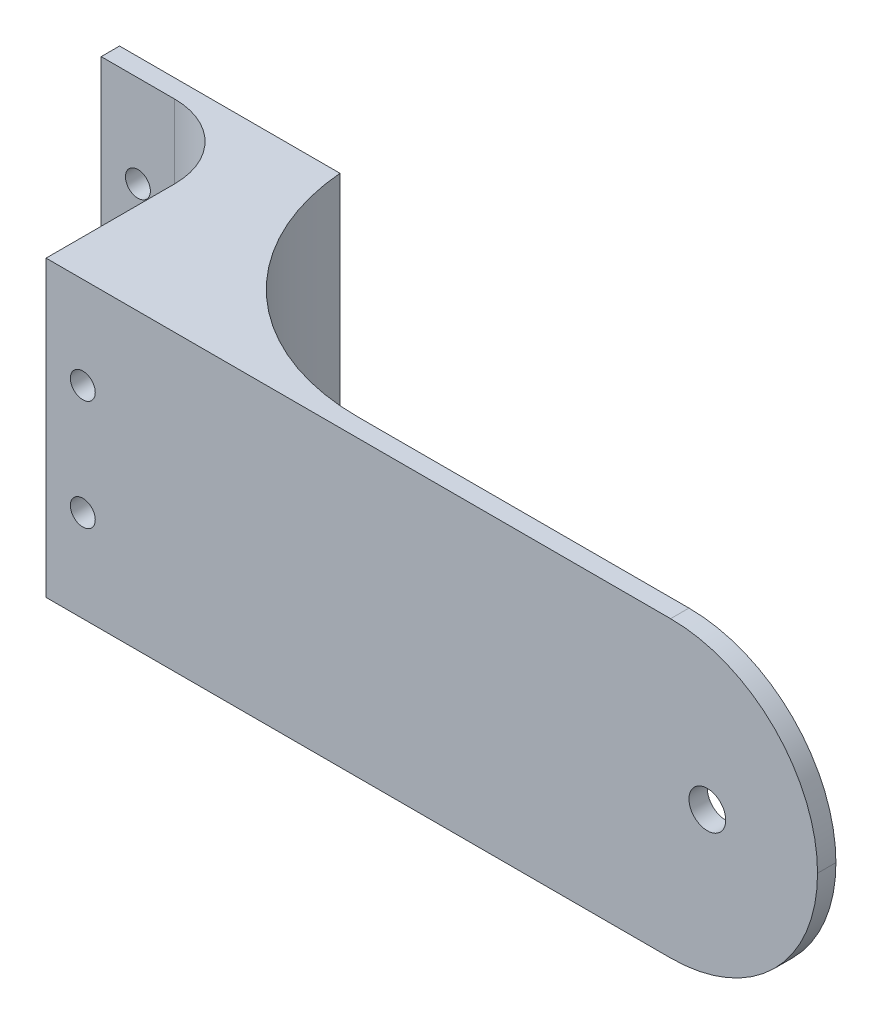
ISO-10303-21;
HEADER;
FILE_DESCRIPTION(('STEP AP214'),'2;1');
FILE_NAME('part.step','',(''),(''),'','','');
FILE_SCHEMA(('AUTOMOTIVE_DESIGN { 1 0 10303 214 1 1 1 1 }'));
ENDSEC;
DATA;
#1=APPLICATION_CONTEXT('core data for automotive mechanical design processes');
#2=APPLICATION_PROTOCOL_DEFINITION('international standard','automotive_design',2000,#1);
#3=PRODUCT_CONTEXT('',#1,'mechanical');
#4=PRODUCT('Part','Part','',(#3));
#5=PRODUCT_RELATED_PRODUCT_CATEGORY('part','',(#4));
#6=PRODUCT_DEFINITION_FORMATION('','',#4);
#7=PRODUCT_DEFINITION_CONTEXT('part definition',#1,'design');
#8=PRODUCT_DEFINITION('design','',#6,#7);
#9=PRODUCT_DEFINITION_SHAPE('','',#8);
#10=(LENGTH_UNIT() NAMED_UNIT(*) SI_UNIT(.MILLI.,.METRE.));
#11=(NAMED_UNIT(*) PLANE_ANGLE_UNIT() SI_UNIT($,.RADIAN.));
#12=(NAMED_UNIT(*) SI_UNIT($,.STERADIAN.) SOLID_ANGLE_UNIT());
#13=UNCERTAINTY_MEASURE_WITH_UNIT(LENGTH_MEASURE(1.E-05),#10,'distance_accuracy_value','');
#14=(GEOMETRIC_REPRESENTATION_CONTEXT(3) GLOBAL_UNCERTAINTY_ASSIGNED_CONTEXT((#13)) GLOBAL_UNIT_ASSIGNED_CONTEXT((#10,
#11,#12)) REPRESENTATION_CONTEXT('',''));
#15=CARTESIAN_POINT('',(0.,0.,0.));
#16=DIRECTION('',(0.,0.,1.));
#17=DIRECTION('',(1.,0.,0.));
#18=AXIS2_PLACEMENT_3D('',#15,#16,#17);
#19=CARTESIAN_POINT('',(0.,0.,19.05));
#20=DIRECTION('',(0.,0.,1.));
#21=DIRECTION('',(1.,0.,0.));
#22=AXIS2_PLACEMENT_3D('',#19,#20,#21);
#23=PLANE('',#22);
#24=CARTESIAN_POINT('',(-31.75,9.525,19.05));
#25=DIRECTION('',(0.,0.,1.));
#26=DIRECTION('',(1.,0.,0.));
#27=AXIS2_PLACEMENT_3D('',#24,#25,#26);
#28=CIRCLE('',#27,2.15265);
#29=CARTESIAN_POINT('',(-29.59735,9.525,19.05));
#30=VERTEX_POINT('',#29);
#31=EDGE_CURVE('E146',#30,#30,#28,.T.);
#32=ORIENTED_EDGE('',*,*,#31,.F.);
#33=EDGE_LOOP('',(#32));
#34=FACE_BOUND('',#33,.T.);
#35=CARTESIAN_POINT('',(-31.75,-9.525,19.05));
#36=DIRECTION('',(0.,0.,1.));
#37=DIRECTION('',(1.,0.,0.));
#38=AXIS2_PLACEMENT_3D('',#35,#36,#37);
#39=CIRCLE('',#38,2.15265);
#40=CARTESIAN_POINT('',(-29.59735,-9.525,19.05));
#41=VERTEX_POINT('',#40);
#42=EDGE_CURVE('E265',#41,#41,#39,.T.);
#43=ORIENTED_EDGE('',*,*,#42,.F.);
#44=EDGE_LOOP('',(#43));
#45=FACE_BOUND('',#44,.T.);
#46=DIRECTION('',(1.,0.,0.));
#47=VECTOR('',#46,1.);
#48=CARTESIAN_POINT('',(-38.1,-25.4,19.05));
#49=LINE('',#48,#47);
#50=CARTESIAN_POINT('',(-38.1,-25.4,19.05));
#51=VERTEX_POINT('',#50);
#52=CARTESIAN_POINT('',(-25.4,-25.4,19.05));
#53=VERTEX_POINT('',#52);
#54=EDGE_CURVE('E159',#51,#53,#49,.T.);
#55=ORIENTED_EDGE('',*,*,#54,.T.);
#56=DIRECTION('',(0.,1.,0.));
#57=VECTOR('',#56,1.);
#58=CARTESIAN_POINT('',(-25.4,25.4,19.05));
#59=LINE('',#58,#57);
#60=CARTESIAN_POINT('',(-25.4,25.4,19.05));
#61=VERTEX_POINT('',#60);
#62=EDGE_CURVE('E183',#53,#61,#59,.T.);
#63=ORIENTED_EDGE('',*,*,#62,.T.);
#64=DIRECTION('',(-1.,0.,0.));
#65=VECTOR('',#64,1.);
#66=CARTESIAN_POINT('',(0.,25.4,19.05));
#67=LINE('',#66,#65);
#68=CARTESIAN_POINT('',(-38.1,25.4,19.05));
#69=VERTEX_POINT('',#68);
#70=EDGE_CURVE('E152',#61,#69,#67,.T.);
#71=ORIENTED_EDGE('',*,*,#70,.T.);
#72=DIRECTION('',(0.,-1.,0.));
#73=VECTOR('',#72,1.);
#74=CARTESIAN_POINT('',(-38.1,25.4,19.05));
#75=LINE('',#74,#73);
#76=EDGE_CURVE('E155',#69,#51,#75,.T.);
#77=ORIENTED_EDGE('',*,*,#76,.T.);
#78=EDGE_LOOP('',(#55,#63,#71,#77));
#79=FACE_BOUND('',#78,.T.);
#80=ADVANCED_FACE('F39',(#34,#45,#79),#23,.T.);
#81=CARTESIAN_POINT('',(0.,25.4,19.05));
#82=DIRECTION('',(0.,-1.,0.));
#83=DIRECTION('',(0.,0.,-1.));
#84=AXIS2_PLACEMENT_3D('',#81,#82,#83);
#85=PLANE('',#84);
#86=DIRECTION('',(-1.,0.,0.));
#87=VECTOR('',#86,1.);
#88=CARTESIAN_POINT('',(-12.7,25.4,53.975));
#89=LINE('',#88,#87);
#90=CARTESIAN_POINT('',(95.25,25.4,53.975));
#91=VERTEX_POINT('',#90);
#92=CARTESIAN_POINT('',(-12.7,25.4,53.975));
#93=VERTEX_POINT('',#92);
#94=EDGE_CURVE('E112',#91,#93,#89,.T.);
#95=ORIENTED_EDGE('',*,*,#94,.F.);
#96=DIRECTION('',(0.,0.,-1.));
#97=VECTOR('',#96,1.);
#98=CARTESIAN_POINT('',(95.25,25.4,19.05));
#99=LINE('',#98,#97);
#100=CARTESIAN_POINT('',(95.25,25.4,50.8));
#101=VERTEX_POINT('',#100);
#102=EDGE_CURVE('E11',#91,#101,#99,.T.);
#103=ORIENTED_EDGE('',*,*,#102,.T.);
#104=DIRECTION('',(-1.,0.,0.));
#105=VECTOR('',#104,1.);
#106=CARTESIAN_POINT('',(0.,25.4,50.8));
#107=LINE('',#106,#105);
#108=CARTESIAN_POINT('',(37.9674778593469,25.4,50.8));
#109=VERTEX_POINT('',#108);
#110=EDGE_CURVE('E121',#101,#109,#107,.T.);
#111=ORIENTED_EDGE('',*,*,#110,.T.);
#112=CARTESIAN_POINT('',(37.9674778593469,25.4,12.7));
#113=DIRECTION('',(0.,-1.,0.));
#114=DIRECTION('',(0.,0.,-1.));
#115=AXIS2_PLACEMENT_3D('',#112,#113,#114);
#116=CIRCLE('',#115,38.1);
#117=CARTESIAN_POINT('',(0.,25.4,15.875));
#118=VERTEX_POINT('',#117);
#119=EDGE_CURVE('E199',#109,#118,#116,.T.);
#120=ORIENTED_EDGE('',*,*,#119,.T.);
#121=DIRECTION('',(-1.,0.,0.));
#122=VECTOR('',#121,1.);
#123=CARTESIAN_POINT('',(0.,25.4,15.875));
#124=LINE('',#123,#122);
#125=CARTESIAN_POINT('',(-38.1,25.4,15.875));
#126=VERTEX_POINT('',#125);
#127=EDGE_CURVE('E167',#118,#126,#124,.T.);
#128=ORIENTED_EDGE('',*,*,#127,.T.);
#129=DIRECTION('',(0.,0.,-1.));
#130=VECTOR('',#129,1.);
#131=CARTESIAN_POINT('',(-38.1,25.4,19.05));
#132=LINE('',#131,#130);
#133=EDGE_CURVE('E179',#69,#126,#132,.T.);
#134=ORIENTED_EDGE('',*,*,#133,.F.);
#135=ORIENTED_EDGE('',*,*,#70,.F.);
#136=CARTESIAN_POINT('',(-25.4,25.4,31.75));
#137=DIRECTION('',(0.,-1.,0.));
#138=DIRECTION('',(0.,0.,-1.));
#139=AXIS2_PLACEMENT_3D('',#136,#137,#138);
#140=CIRCLE('',#139,12.7);
#141=CARTESIAN_POINT('',(-12.7,25.4,31.75));
#142=VERTEX_POINT('',#141);
#143=EDGE_CURVE('E127',#61,#142,#140,.T.);
#144=ORIENTED_EDGE('',*,*,#143,.T.);
#145=DIRECTION('',(0.,0.,1.));
#146=VECTOR('',#145,1.);
#147=CARTESIAN_POINT('',(-12.7,25.4,-33.3134414453443));
#148=LINE('',#147,#146);
#149=EDGE_CURVE('E124',#142,#93,#148,.T.);
#150=ORIENTED_EDGE('',*,*,#149,.T.);
#151=EDGE_LOOP('',(#95,#103,#111,#120,#128,#134,#135,#144,#150));
#152=FACE_BOUND('',#151,.T.);
#153=ADVANCED_FACE('F125',(#152),#85,.F.);
#154=CARTESIAN_POINT('',(-38.1,25.4,19.05));
#155=DIRECTION('',(1.,0.,0.));
#156=DIRECTION('',(0.,1.,0.));
#157=AXIS2_PLACEMENT_3D('',#154,#155,#156);
#158=PLANE('',#157);
#159=DIRECTION('',(0.,-1.,0.));
#160=VECTOR('',#159,1.);
#161=CARTESIAN_POINT('',(-38.1,25.4,15.875));
#162=LINE('',#161,#160);
#163=CARTESIAN_POINT('',(-38.1,-25.4,15.875));
#164=VERTEX_POINT('',#163);
#165=EDGE_CURVE('E170',#126,#164,#162,.T.);
#166=ORIENTED_EDGE('',*,*,#165,.T.);
#167=DIRECTION('',(0.,0.,-1.));
#168=VECTOR('',#167,1.);
#169=CARTESIAN_POINT('',(-38.1,-25.4,19.05));
#170=LINE('',#169,#168);
#171=EDGE_CURVE('E163',#51,#164,#170,.T.);
#172=ORIENTED_EDGE('',*,*,#171,.F.);
#173=ORIENTED_EDGE('',*,*,#76,.F.);
#174=ORIENTED_EDGE('',*,*,#133,.T.);
#175=EDGE_LOOP('',(#166,#172,#173,#174));
#176=FACE_BOUND('',#175,.T.);
#177=ADVANCED_FACE('F329',(#176),#158,.F.);
#178=CARTESIAN_POINT('',(-25.4,-25.4,19.05));
#179=DIRECTION('',(0.,1.,0.));
#180=DIRECTION('',(-1.,0.,0.));
#181=AXIS2_PLACEMENT_3D('',#178,#179,#180);
#182=PLANE('',#181);
#183=DIRECTION('',(1.,0.,0.));
#184=VECTOR('',#183,1.);
#185=CARTESIAN_POINT('',(120.65,-25.4,50.8));
#186=LINE('',#185,#184);
#187=CARTESIAN_POINT('',(37.9674778593469,-25.4,50.8));
#188=VERTEX_POINT('',#187);
#189=CARTESIAN_POINT('',(95.25,-25.4,50.8));
#190=VERTEX_POINT('',#189);
#191=EDGE_CURVE('E142',#188,#190,#186,.T.);
#192=ORIENTED_EDGE('',*,*,#191,.T.);
#193=DIRECTION('',(0.,0.,-1.));
#194=VECTOR('',#193,1.);
#195=CARTESIAN_POINT('',(95.25,-25.4,19.05));
#196=LINE('',#195,#194);
#197=CARTESIAN_POINT('',(95.25,-25.3999999999999,53.975));
#198=VERTEX_POINT('',#197);
#199=EDGE_CURVE('E211',#190,#198,#196,.F.);
#200=ORIENTED_EDGE('',*,*,#199,.T.);
#201=DIRECTION('',(1.,0.,0.));
#202=VECTOR('',#201,1.);
#203=CARTESIAN_POINT('',(0.,-25.4,53.975));
#204=LINE('',#203,#202);
#205=CARTESIAN_POINT('',(-12.7,-25.4,53.975));
#206=VERTEX_POINT('',#205);
#207=EDGE_CURVE('E132',#206,#198,#204,.T.);
#208=ORIENTED_EDGE('',*,*,#207,.F.);
#209=DIRECTION('',(0.,0.,1.));
#210=VECTOR('',#209,1.);
#211=CARTESIAN_POINT('',(-12.7,-25.4,-33.3134414453443));
#212=LINE('',#211,#210);
#213=CARTESIAN_POINT('',(-12.7,-25.4,31.75));
#214=VERTEX_POINT('',#213);
#215=EDGE_CURVE('E131',#214,#206,#212,.T.);
#216=ORIENTED_EDGE('',*,*,#215,.F.);
#217=CARTESIAN_POINT('',(-25.4,-25.4,31.75));
#218=DIRECTION('',(0.,1.,0.));
#219=DIRECTION('',(-1.,0.,0.));
#220=AXIS2_PLACEMENT_3D('',#217,#218,#219);
#221=CIRCLE('',#220,12.7);
#222=EDGE_CURVE('E192',#214,#53,#221,.T.);
#223=ORIENTED_EDGE('',*,*,#222,.T.);
#224=ORIENTED_EDGE('',*,*,#54,.F.);
#225=ORIENTED_EDGE('',*,*,#171,.T.);
#226=DIRECTION('',(1.,0.,0.));
#227=VECTOR('',#226,1.);
#228=CARTESIAN_POINT('',(-25.4,-25.4,15.875));
#229=LINE('',#228,#227);
#230=CARTESIAN_POINT('',(0.,-25.4,15.875));
#231=VERTEX_POINT('',#230);
#232=EDGE_CURVE('E156',#164,#231,#229,.T.);
#233=ORIENTED_EDGE('',*,*,#232,.T.);
#234=CARTESIAN_POINT('',(37.9674778593469,-25.4,12.7));
#235=DIRECTION('',(0.,1.,0.));
#236=DIRECTION('',(-1.,0.,0.));
#237=AXIS2_PLACEMENT_3D('',#234,#235,#236);
#238=CIRCLE('',#237,38.1);
#239=EDGE_CURVE('E202',#231,#188,#238,.T.);
#240=ORIENTED_EDGE('',*,*,#239,.T.);
#241=EDGE_LOOP('',(#192,#200,#208,#216,#223,#224,#225,#233,#240));
#242=FACE_BOUND('',#241,.T.);
#243=ADVANCED_FACE('F220',(#242),#182,.F.);
#244=CARTESIAN_POINT('',(0.,0.,15.875));
#245=DIRECTION('',(0.,0.,1.));
#246=DIRECTION('',(1.,0.,0.));
#247=AXIS2_PLACEMENT_3D('',#244,#245,#246);
#248=PLANE('',#247);
#249=CARTESIAN_POINT('',(-31.75,9.525,15.875));
#250=DIRECTION('',(0.,0.,1.));
#251=DIRECTION('',(1.,0.,0.));
#252=AXIS2_PLACEMENT_3D('',#249,#250,#251);
#253=CIRCLE('',#252,2.15265);
#254=CARTESIAN_POINT('',(-29.59735,9.525,15.875));
#255=VERTEX_POINT('',#254);
#256=EDGE_CURVE('E246',#255,#255,#253,.F.);
#257=ORIENTED_EDGE('',*,*,#256,.F.);
#258=EDGE_LOOP('',(#257));
#259=FACE_BOUND('',#258,.T.);
#260=CARTESIAN_POINT('',(-6.34999999999999,-9.525,15.875));
#261=DIRECTION('',(0.,0.,1.));
#262=DIRECTION('',(1.,0.,0.));
#263=AXIS2_PLACEMENT_3D('',#260,#261,#262);
#264=CIRCLE('',#263,2.15265);
#265=CARTESIAN_POINT('',(-4.19734999999999,-9.525,15.875));
#266=VERTEX_POINT('',#265);
#267=EDGE_CURVE('E251',#266,#266,#264,.F.);
#268=ORIENTED_EDGE('',*,*,#267,.F.);
#269=EDGE_LOOP('',(#268));
#270=FACE_BOUND('',#269,.T.);
#271=CARTESIAN_POINT('',(-31.75,-9.525,15.875));
#272=DIRECTION('',(0.,0.,1.));
#273=DIRECTION('',(1.,0.,0.));
#274=AXIS2_PLACEMENT_3D('',#271,#272,#273);
#275=CIRCLE('',#274,2.15265);
#276=CARTESIAN_POINT('',(-29.59735,-9.525,15.875));
#277=VERTEX_POINT('',#276);
#278=EDGE_CURVE('E230',#277,#277,#275,.F.);
#279=ORIENTED_EDGE('',*,*,#278,.F.);
#280=EDGE_LOOP('',(#279));
#281=FACE_BOUND('',#280,.T.);
#282=CARTESIAN_POINT('',(-6.34999999999999,9.525,15.875));
#283=DIRECTION('',(0.,0.,1.));
#284=DIRECTION('',(1.,0.,0.));
#285=AXIS2_PLACEMENT_3D('',#282,#283,#284);
#286=CIRCLE('',#285,2.15265);
#287=CARTESIAN_POINT('',(-4.19734999999999,9.525,15.875));
#288=VERTEX_POINT('',#287);
#289=EDGE_CURVE('E261',#288,#288,#286,.F.);
#290=ORIENTED_EDGE('',*,*,#289,.F.);
#291=EDGE_LOOP('',(#290));
#292=FACE_BOUND('',#291,.T.);
#293=DIRECTION('',(0.,1.,0.));
#294=VECTOR('',#293,1.);
#295=CARTESIAN_POINT('',(0.,-25.4,15.875));
#296=LINE('',#295,#294);
#297=EDGE_CURVE('E150',#231,#118,#296,.T.);
#298=ORIENTED_EDGE('',*,*,#297,.F.);
#299=ORIENTED_EDGE('',*,*,#232,.F.);
#300=ORIENTED_EDGE('',*,*,#165,.F.);
#301=ORIENTED_EDGE('',*,*,#127,.F.);
#302=EDGE_LOOP('',(#298,#299,#300,#301));
#303=FACE_BOUND('',#302,.T.);
#304=ADVANCED_FACE('F296',(#259,#270,#281,#292,#303),#248,.F.);
#305=CARTESIAN_POINT('',(-12.7,25.4,-33.3134414453443));
#306=DIRECTION('',(-1.,0.,0.));
#307=DIRECTION('',(0.,-1.,0.));
#308=AXIS2_PLACEMENT_3D('',#305,#306,#307);
#309=PLANE('',#308);
#310=ORIENTED_EDGE('',*,*,#149,.F.);
#311=DIRECTION('',(0.,1.,0.));
#312=VECTOR('',#311,1.);
#313=CARTESIAN_POINT('',(-12.7,-25.4,31.75));
#314=LINE('',#313,#312);
#315=EDGE_CURVE('E187',#142,#214,#314,.F.);
#316=ORIENTED_EDGE('',*,*,#315,.T.);
#317=ORIENTED_EDGE('',*,*,#215,.T.);
#318=DIRECTION('',(0.,-1.,0.));
#319=VECTOR('',#318,1.);
#320=CARTESIAN_POINT('',(-12.7,-25.4,53.975));
#321=LINE('',#320,#319);
#322=EDGE_CURVE('E116',#93,#206,#321,.T.);
#323=ORIENTED_EDGE('',*,*,#322,.F.);
#324=EDGE_LOOP('',(#310,#316,#317,#323));
#325=FACE_BOUND('',#324,.T.);
#326=ADVANCED_FACE('F134',(#325),#309,.T.);
#327=CARTESIAN_POINT('',(-25.4,0.,31.75));
#328=DIRECTION('',(0.,-1.,0.));
#329=DIRECTION('',(1.,0.,0.));
#330=AXIS2_PLACEMENT_3D('',#327,#328,#329);
#331=CYLINDRICAL_SURFACE('',#330,12.7);
#332=ORIENTED_EDGE('',*,*,#222,.F.);
#333=ORIENTED_EDGE('',*,*,#315,.F.);
#334=ORIENTED_EDGE('',*,*,#143,.F.);
#335=ORIENTED_EDGE('',*,*,#62,.F.);
#336=EDGE_LOOP('',(#332,#333,#334,#335));
#337=FACE_BOUND('',#336,.T.);
#338=ADVANCED_FACE('F286',(#337),#331,.F.);
#339=CARTESIAN_POINT('',(0.,0.,53.975));
#340=DIRECTION('',(0.,0.,-1.));
#341=DIRECTION('',(-1.,0.,0.));
#342=AXIS2_PLACEMENT_3D('',#339,#340,#341);
#343=PLANE('',#342);
#344=CARTESIAN_POINT('',(101.6,0.,53.975));
#345=DIRECTION('',(0.,0.,1.));
#346=DIRECTION('',(1.,0.,0.));
#347=AXIS2_PLACEMENT_3D('',#344,#345,#346);
#348=CIRCLE('',#347,3.175);
#349=CARTESIAN_POINT('',(104.775,0.,53.975));
#350=VERTEX_POINT('',#349);
#351=EDGE_CURVE('E231',#350,#350,#348,.T.);
#352=ORIENTED_EDGE('',*,*,#351,.F.);
#353=EDGE_LOOP('',(#352));
#354=FACE_BOUND('',#353,.T.);
#355=CARTESIAN_POINT('',(-6.34999999999999,-9.525,53.975));
#356=DIRECTION('',(0.,0.,1.));
#357=DIRECTION('',(-1.,0.,0.));
#358=AXIS2_PLACEMENT_3D('',#355,#356,#357);
#359=CIRCLE('',#358,2.15265);
#360=CARTESIAN_POINT('',(-4.19734999999999,-9.525,53.975));
#361=VERTEX_POINT('',#360);
#362=EDGE_CURVE('E235',#361,#361,#359,.T.);
#363=ORIENTED_EDGE('',*,*,#362,.F.);
#364=EDGE_LOOP('',(#363));
#365=FACE_BOUND('',#364,.T.);
#366=CARTESIAN_POINT('',(-6.34999999999999,9.525,53.975));
#367=DIRECTION('',(0.,0.,1.));
#368=DIRECTION('',(1.,0.,0.));
#369=AXIS2_PLACEMENT_3D('',#366,#367,#368);
#370=CIRCLE('',#369,2.15265);
#371=CARTESIAN_POINT('',(-4.19734999999999,9.525,53.975));
#372=VERTEX_POINT('',#371);
#373=EDGE_CURVE('E250',#372,#372,#370,.T.);
#374=ORIENTED_EDGE('',*,*,#373,.F.);
#375=EDGE_LOOP('',(#374));
#376=FACE_BOUND('',#375,.T.);
#377=ORIENTED_EDGE('',*,*,#207,.T.);
#378=CARTESIAN_POINT('',(95.25,0.,53.975));
#379=DIRECTION('',(0.,0.,-1.));
#380=DIRECTION('',(-1.,0.,0.));
#381=AXIS2_PLACEMENT_3D('',#378,#379,#380);
#382=CIRCLE('',#381,25.4);
#383=CARTESIAN_POINT('',(120.65,0.,53.975));
#384=VERTEX_POINT('',#383);
#385=EDGE_CURVE('E49',#198,#384,#382,.F.);
#386=ORIENTED_EDGE('',*,*,#385,.T.);
#387=CARTESIAN_POINT('',(95.25,0.,53.975));
#388=DIRECTION('',(0.,0.,-1.));
#389=DIRECTION('',(-1.,0.,0.));
#390=AXIS2_PLACEMENT_3D('',#387,#388,#389);
#391=CIRCLE('',#390,25.4);
#392=EDGE_CURVE('E59',#384,#91,#391,.F.);
#393=ORIENTED_EDGE('',*,*,#392,.T.);
#394=ORIENTED_EDGE('',*,*,#94,.T.);
#395=ORIENTED_EDGE('',*,*,#322,.T.);
#396=EDGE_LOOP('',(#377,#386,#393,#394,#395));
#397=FACE_BOUND('',#396,.T.);
#398=ADVANCED_FACE('F114',(#354,#365,#376,#397),#343,.F.);
#399=CARTESIAN_POINT('',(0.,0.,50.8));
#400=DIRECTION('',(0.,0.,-1.));
#401=DIRECTION('',(-1.,0.,0.));
#402=AXIS2_PLACEMENT_3D('',#399,#400,#401);
#403=PLANE('',#402);
#404=CARTESIAN_POINT('',(101.6,0.,50.8));
#405=DIRECTION('',(0.,0.,-1.));
#406=DIRECTION('',(-1.,0.,0.));
#407=AXIS2_PLACEMENT_3D('',#404,#405,#406);
#408=CIRCLE('',#407,3.175);
#409=CARTESIAN_POINT('',(98.425,0.,50.8));
#410=VERTEX_POINT('',#409);
#411=EDGE_CURVE('E238',#410,#410,#408,.F.);
#412=ORIENTED_EDGE('',*,*,#411,.T.);
#413=EDGE_LOOP('',(#412));
#414=FACE_BOUND('',#413,.T.);
#415=CARTESIAN_POINT('',(95.25,0.,50.8));
#416=DIRECTION('',(0.,0.,-1.));
#417=DIRECTION('',(-1.,0.,0.));
#418=AXIS2_PLACEMENT_3D('',#415,#416,#417);
#419=CIRCLE('',#418,25.4);
#420=CARTESIAN_POINT('',(120.65,0.,50.8));
#421=VERTEX_POINT('',#420);
#422=EDGE_CURVE('E205',#101,#421,#419,.T.);
#423=ORIENTED_EDGE('',*,*,#422,.T.);
#424=CARTESIAN_POINT('',(95.25,0.,50.8));
#425=DIRECTION('',(0.,0.,-1.));
#426=DIRECTION('',(-1.,0.,0.));
#427=AXIS2_PLACEMENT_3D('',#424,#425,#426);
#428=CIRCLE('',#427,25.4);
#429=EDGE_CURVE('E208',#421,#190,#428,.T.);
#430=ORIENTED_EDGE('',*,*,#429,.T.);
#431=ORIENTED_EDGE('',*,*,#191,.F.);
#432=DIRECTION('',(0.,-1.,0.));
#433=VECTOR('',#432,1.);
#434=CARTESIAN_POINT('',(37.9674778593469,25.4,50.8));
#435=LINE('',#434,#433);
#436=EDGE_CURVE('E195',#188,#109,#435,.F.);
#437=ORIENTED_EDGE('',*,*,#436,.T.);
#438=ORIENTED_EDGE('',*,*,#110,.F.);
#439=EDGE_LOOP('',(#423,#430,#431,#437,#438));
#440=FACE_BOUND('',#439,.T.);
#441=ADVANCED_FACE('F293',(#414,#440),#403,.T.);
#442=CARTESIAN_POINT('',(37.9674778593469,-25.4,12.7));
#443=DIRECTION('',(0.,1.,0.));
#444=DIRECTION('',(-1.,0.,0.));
#445=AXIS2_PLACEMENT_3D('',#442,#443,#444);
#446=CYLINDRICAL_SURFACE('',#445,38.1);
#447=ORIENTED_EDGE('',*,*,#239,.F.);
#448=ORIENTED_EDGE('',*,*,#297,.T.);
#449=ORIENTED_EDGE('',*,*,#119,.F.);
#450=ORIENTED_EDGE('',*,*,#436,.F.);
#451=EDGE_LOOP('',(#447,#448,#449,#450));
#452=FACE_BOUND('',#451,.T.);
#453=ADVANCED_FACE('F301',(#452),#446,.F.);
#454=CARTESIAN_POINT('',(-6.34999999999999,9.525,9.78638634991511));
#455=DIRECTION('',(0.,0.,1.));
#456=DIRECTION('',(1.,0.,0.));
#457=AXIS2_PLACEMENT_3D('',#454,#455,#456);
#458=CYLINDRICAL_SURFACE('',#457,2.15265);
#459=CARTESIAN_POINT('',(-4.19734999999999,9.525,15.875));
#460=CARTESIAN_POINT('',(-4.19734999999999,9.525,16.271875));
#461=CARTESIAN_POINT('',(-4.19734999999999,9.525,16.66875));
#462=CARTESIAN_POINT('',(-4.19734999999999,9.525,17.4625));
#463=CARTESIAN_POINT('',(-4.19734999999999,9.525,17.859375));
#464=CARTESIAN_POINT('',(-4.19734999999999,9.525,18.653125));
#465=CARTESIAN_POINT('',(-4.19734999999999,9.525,19.05));
#466=CARTESIAN_POINT('',(-4.19734999999999,9.525,19.84375));
#467=CARTESIAN_POINT('',(-4.19734999999999,9.525,20.240625));
#468=CARTESIAN_POINT('',(-4.19734999999999,9.525,21.034375));
#469=CARTESIAN_POINT('',(-4.19734999999999,9.525,21.43125));
#470=CARTESIAN_POINT('',(-4.19734999999999,9.525,22.225));
#471=CARTESIAN_POINT('',(-4.19734999999999,9.525,22.621875));
#472=CARTESIAN_POINT('',(-4.19734999999999,9.525,23.415625));
#473=CARTESIAN_POINT('',(-4.19734999999999,9.525,23.8125));
#474=CARTESIAN_POINT('',(-4.19734999999999,9.525,24.60625));
#475=CARTESIAN_POINT('',(-4.19734999999999,9.525,25.003125));
#476=CARTESIAN_POINT('',(-4.19734999999999,9.525,25.796875));
#477=CARTESIAN_POINT('',(-4.19734999999999,9.525,26.19375));
#478=CARTESIAN_POINT('',(-4.19734999999999,9.525,26.9875));
#479=CARTESIAN_POINT('',(-4.19734999999999,9.525,27.384375));
#480=CARTESIAN_POINT('',(-4.19734999999999,9.525,28.178125));
#481=CARTESIAN_POINT('',(-4.19734999999999,9.525,28.575));
#482=CARTESIAN_POINT('',(-4.19734999999999,9.525,29.36875));
#483=CARTESIAN_POINT('',(-4.19734999999999,9.525,29.765625));
#484=CARTESIAN_POINT('',(-4.19734999999999,9.525,30.559375));
#485=CARTESIAN_POINT('',(-4.19734999999999,9.525,30.95625));
#486=CARTESIAN_POINT('',(-4.19734999999999,9.525,31.75));
#487=CARTESIAN_POINT('',(-4.19734999999999,9.525,32.146875));
#488=CARTESIAN_POINT('',(-4.19734999999999,9.525,32.940625));
#489=CARTESIAN_POINT('',(-4.19734999999999,9.525,33.3375));
#490=CARTESIAN_POINT('',(-4.19734999999999,9.525,34.13125));
#491=CARTESIAN_POINT('',(-4.19734999999999,9.525,34.528125));
#492=CARTESIAN_POINT('',(-4.19734999999999,9.525,35.321875));
#493=CARTESIAN_POINT('',(-4.19734999999999,9.525,35.71875));
#494=CARTESIAN_POINT('',(-4.19734999999999,9.525,36.5125));
#495=CARTESIAN_POINT('',(-4.19734999999999,9.525,36.909375));
#496=CARTESIAN_POINT('',(-4.19734999999999,9.525,37.703125));
#497=CARTESIAN_POINT('',(-4.19734999999999,9.525,38.1));
#498=CARTESIAN_POINT('',(-4.19734999999999,9.525,38.89375));
#499=CARTESIAN_POINT('',(-4.19734999999999,9.525,39.290625));
#500=CARTESIAN_POINT('',(-4.19734999999999,9.525,40.084375));
#501=CARTESIAN_POINT('',(-4.19734999999999,9.525,40.48125));
#502=CARTESIAN_POINT('',(-4.19734999999999,9.525,41.275));
#503=CARTESIAN_POINT('',(-4.19734999999999,9.525,41.671875));
#504=CARTESIAN_POINT('',(-4.19734999999999,9.525,42.465625));
#505=CARTESIAN_POINT('',(-4.19734999999999,9.525,42.8625));
#506=CARTESIAN_POINT('',(-4.19734999999999,9.525,43.65625));
#507=CARTESIAN_POINT('',(-4.19734999999999,9.525,44.053125));
#508=CARTESIAN_POINT('',(-4.19734999999999,9.525,44.846875));
#509=CARTESIAN_POINT('',(-4.19734999999999,9.525,45.24375));
#510=CARTESIAN_POINT('',(-4.19734999999999,9.525,46.0375));
#511=CARTESIAN_POINT('',(-4.19734999999999,9.525,46.434375));
#512=CARTESIAN_POINT('',(-4.19734999999999,9.525,47.228125));
#513=CARTESIAN_POINT('',(-4.19734999999999,9.525,47.625));
#514=CARTESIAN_POINT('',(-4.19734999999999,9.525,48.41875));
#515=CARTESIAN_POINT('',(-4.19734999999999,9.525,48.815625));
#516=CARTESIAN_POINT('',(-4.19734999999999,9.525,49.609375));
#517=CARTESIAN_POINT('',(-4.19734999999999,9.525,50.00625));
#518=CARTESIAN_POINT('',(-4.19734999999999,9.525,50.8));
#519=CARTESIAN_POINT('',(-4.19734999999999,9.525,51.196875));
#520=CARTESIAN_POINT('',(-4.19734999999999,9.525,51.990625));
#521=CARTESIAN_POINT('',(-4.19734999999999,9.525,52.3875));
#522=CARTESIAN_POINT('',(-4.19734999999999,9.525,53.18125));
#523=CARTESIAN_POINT('',(-4.19734999999999,9.525,53.578125));
#524=CARTESIAN_POINT('',(-4.19734999999999,9.525,53.975));
#525=B_SPLINE_CURVE_WITH_KNOTS('',3,(#459,#460,#461,#462,#463,#464,#465,#466,#467,#468,#469,
#470,#471,#472,#473,#474,#475,#476,#477,#478,#479,#480,#481,#482,#483,#484,#485,#486,#487,#488,
#489,#490,#491,#492,#493,#494,#495,#496,#497,#498,#499,#500,#501,#502,#503,#504,#505,#506,#507,
#508,#509,#510,#511,#512,#513,#514,#515,#516,#517,#518,#519,#520,#521,#522,#523,#524),
.UNSPECIFIED.,.F.,.F.,(4,2,2,2,2,2,2,2,2,2,2,2,2,2,2,2,2,2,2,2,2,2,2,2,2,2,2,2,2,2,2,2,4),(0.,
1.190625,2.38125,3.571875,4.7625,5.953125,7.14375,8.334375,9.525,10.715625,11.90625,13.096875,
14.2875,15.478125,16.66875,17.859375,19.05,20.240625,21.43125,22.621875,23.8125,25.003125,
26.19375,27.384375,28.575,29.765625,30.95625,32.146875,33.3375,34.528125,35.71875,36.909375,
38.1),.UNSPECIFIED.);
#526=EDGE_CURVE('BSEAM303',#288,#372,#525,.T.);
#527=ORIENTED_EDGE('',*,*,#289,.T.);
#528=ORIENTED_EDGE('',*,*,#373,.T.);
#529=ORIENTED_EDGE('',*,*,#526,.T.);
#530=ORIENTED_EDGE('',*,*,#526,.F.);
#531=EDGE_LOOP('',(#527,#529,#528,#530));
#532=FACE_BOUND('',#531,.T.);
#533=ADVANCED_FACE('F303',(#532),#458,.F.);
#534=CARTESIAN_POINT('',(-6.34999999999999,-9.525,9.78638634991511));
#535=DIRECTION('',(0.,0.,1.));
#536=DIRECTION('',(1.,0.,0.));
#537=AXIS2_PLACEMENT_3D('',#534,#535,#536);
#538=CYLINDRICAL_SURFACE('',#537,2.15265);
#539=CARTESIAN_POINT('',(-4.19734999999999,-9.525,15.875));
#540=CARTESIAN_POINT('',(-4.19734999999999,-9.525,16.271875));
#541=CARTESIAN_POINT('',(-4.19734999999999,-9.525,16.66875));
#542=CARTESIAN_POINT('',(-4.19734999999999,-9.525,17.4625));
#543=CARTESIAN_POINT('',(-4.19734999999999,-9.525,17.859375));
#544=CARTESIAN_POINT('',(-4.19734999999999,-9.525,18.653125));
#545=CARTESIAN_POINT('',(-4.19734999999999,-9.525,19.05));
#546=CARTESIAN_POINT('',(-4.19734999999999,-9.525,19.84375));
#547=CARTESIAN_POINT('',(-4.19734999999999,-9.525,20.240625));
#548=CARTESIAN_POINT('',(-4.19734999999999,-9.525,21.034375));
#549=CARTESIAN_POINT('',(-4.19734999999999,-9.525,21.43125));
#550=CARTESIAN_POINT('',(-4.19734999999999,-9.525,22.225));
#551=CARTESIAN_POINT('',(-4.19734999999999,-9.525,22.621875));
#552=CARTESIAN_POINT('',(-4.19734999999999,-9.525,23.415625));
#553=CARTESIAN_POINT('',(-4.19734999999999,-9.525,23.8125));
#554=CARTESIAN_POINT('',(-4.19734999999999,-9.525,24.60625));
#555=CARTESIAN_POINT('',(-4.19734999999999,-9.525,25.003125));
#556=CARTESIAN_POINT('',(-4.19734999999999,-9.525,25.796875));
#557=CARTESIAN_POINT('',(-4.19734999999999,-9.525,26.19375));
#558=CARTESIAN_POINT('',(-4.19734999999999,-9.525,26.9875));
#559=CARTESIAN_POINT('',(-4.19734999999999,-9.525,27.384375));
#560=CARTESIAN_POINT('',(-4.19734999999999,-9.525,28.178125));
#561=CARTESIAN_POINT('',(-4.19734999999999,-9.525,28.575));
#562=CARTESIAN_POINT('',(-4.19734999999999,-9.525,29.36875));
#563=CARTESIAN_POINT('',(-4.19734999999999,-9.525,29.765625));
#564=CARTESIAN_POINT('',(-4.19734999999999,-9.525,30.559375));
#565=CARTESIAN_POINT('',(-4.19734999999999,-9.525,30.95625));
#566=CARTESIAN_POINT('',(-4.19734999999999,-9.525,31.75));
#567=CARTESIAN_POINT('',(-4.19734999999999,-9.525,32.146875));
#568=CARTESIAN_POINT('',(-4.19734999999999,-9.525,32.940625));
#569=CARTESIAN_POINT('',(-4.19734999999999,-9.525,33.3375));
#570=CARTESIAN_POINT('',(-4.19734999999999,-9.525,34.13125));
#571=CARTESIAN_POINT('',(-4.19734999999999,-9.525,34.528125));
#572=CARTESIAN_POINT('',(-4.19734999999999,-9.525,35.321875));
#573=CARTESIAN_POINT('',(-4.19734999999999,-9.525,35.71875));
#574=CARTESIAN_POINT('',(-4.19734999999999,-9.525,36.5125));
#575=CARTESIAN_POINT('',(-4.19734999999999,-9.525,36.909375));
#576=CARTESIAN_POINT('',(-4.19734999999999,-9.525,37.703125));
#577=CARTESIAN_POINT('',(-4.19734999999999,-9.525,38.1));
#578=CARTESIAN_POINT('',(-4.19734999999999,-9.525,38.89375));
#579=CARTESIAN_POINT('',(-4.19734999999999,-9.525,39.290625));
#580=CARTESIAN_POINT('',(-4.19734999999999,-9.525,40.084375));
#581=CARTESIAN_POINT('',(-4.19734999999999,-9.525,40.48125));
#582=CARTESIAN_POINT('',(-4.19734999999999,-9.525,41.275));
#583=CARTESIAN_POINT('',(-4.19734999999999,-9.525,41.671875));
#584=CARTESIAN_POINT('',(-4.19734999999999,-9.525,42.465625));
#585=CARTESIAN_POINT('',(-4.19734999999999,-9.525,42.8625));
#586=CARTESIAN_POINT('',(-4.19734999999999,-9.525,43.65625));
#587=CARTESIAN_POINT('',(-4.19734999999999,-9.525,44.053125));
#588=CARTESIAN_POINT('',(-4.19734999999999,-9.525,44.846875));
#589=CARTESIAN_POINT('',(-4.19734999999999,-9.525,45.24375));
#590=CARTESIAN_POINT('',(-4.19734999999999,-9.525,46.0375));
#591=CARTESIAN_POINT('',(-4.19734999999999,-9.525,46.434375));
#592=CARTESIAN_POINT('',(-4.19734999999999,-9.525,47.228125));
#593=CARTESIAN_POINT('',(-4.19734999999999,-9.525,47.625));
#594=CARTESIAN_POINT('',(-4.19734999999999,-9.525,48.41875));
#595=CARTESIAN_POINT('',(-4.19734999999999,-9.525,48.815625));
#596=CARTESIAN_POINT('',(-4.19734999999999,-9.525,49.609375));
#597=CARTESIAN_POINT('',(-4.19734999999999,-9.525,50.00625));
#598=CARTESIAN_POINT('',(-4.19734999999999,-9.525,50.8));
#599=CARTESIAN_POINT('',(-4.19734999999999,-9.525,51.196875));
#600=CARTESIAN_POINT('',(-4.19734999999999,-9.525,51.990625));
#601=CARTESIAN_POINT('',(-4.19734999999999,-9.525,52.3875));
#602=CARTESIAN_POINT('',(-4.19734999999999,-9.525,53.18125));
#603=CARTESIAN_POINT('',(-4.19734999999999,-9.525,53.578125));
#604=CARTESIAN_POINT('',(-4.19734999999999,-9.525,53.975));
#605=B_SPLINE_CURVE_WITH_KNOTS('',3,(#539,#540,#541,#542,#543,#544,#545,#546,#547,#548,#549,
#550,#551,#552,#553,#554,#555,#556,#557,#558,#559,#560,#561,#562,#563,#564,#565,#566,#567,#568,
#569,#570,#571,#572,#573,#574,#575,#576,#577,#578,#579,#580,#581,#582,#583,#584,#585,#586,#587,
#588,#589,#590,#591,#592,#593,#594,#595,#596,#597,#598,#599,#600,#601,#602,#603,#604),
.UNSPECIFIED.,.F.,.F.,(4,2,2,2,2,2,2,2,2,2,2,2,2,2,2,2,2,2,2,2,2,2,2,2,2,2,2,2,2,2,2,2,4),(0.,
1.190625,2.38125,3.571875,4.7625,5.953125,7.14375,8.334375,9.525,10.715625,11.90625,13.096875,
14.2875,15.478125,16.66875,17.859375,19.05,20.240625,21.43125,22.621875,23.8125,25.003125,
26.19375,27.384375,28.575,29.765625,30.95625,32.146875,33.3375,34.528125,35.71875,36.909375,
38.1),.UNSPECIFIED.);
#606=EDGE_CURVE('BSEAM345',#266,#361,#605,.T.);
#607=ORIENTED_EDGE('',*,*,#267,.T.);
#608=ORIENTED_EDGE('',*,*,#362,.T.);
#609=ORIENTED_EDGE('',*,*,#606,.T.);
#610=ORIENTED_EDGE('',*,*,#606,.F.);
#611=EDGE_LOOP('',(#607,#609,#608,#610));
#612=FACE_BOUND('',#611,.T.);
#613=ADVANCED_FACE('F345',(#612),#538,.F.);
#614=CARTESIAN_POINT('',(-31.75,-9.525,9.78638634991511));
#615=DIRECTION('',(0.,0.,1.));
#616=DIRECTION('',(1.,0.,0.));
#617=AXIS2_PLACEMENT_3D('',#614,#615,#616);
#618=CYLINDRICAL_SURFACE('',#617,2.15265);
#619=CARTESIAN_POINT('',(-29.59735,-9.525,19.05));
#620=CARTESIAN_POINT('',(-29.59735,-9.525,19.0169270833333));
#621=CARTESIAN_POINT('',(-29.59735,-9.525,18.9838541666667));
#622=CARTESIAN_POINT('',(-29.59735,-9.525,18.9177083333333));
#623=CARTESIAN_POINT('',(-29.59735,-9.525,18.8846354166667));
#624=CARTESIAN_POINT('',(-29.59735,-9.525,18.8184895833333));
#625=CARTESIAN_POINT('',(-29.59735,-9.525,18.7854166666667));
#626=CARTESIAN_POINT('',(-29.59735,-9.525,18.7192708333333));
#627=CARTESIAN_POINT('',(-29.59735,-9.525,18.6861979166667));
#628=CARTESIAN_POINT('',(-29.59735,-9.525,18.6200520833333));
#629=CARTESIAN_POINT('',(-29.59735,-9.525,18.5869791666667));
#630=CARTESIAN_POINT('',(-29.59735,-9.525,18.5208333333333));
#631=CARTESIAN_POINT('',(-29.59735,-9.525,18.4877604166667));
#632=CARTESIAN_POINT('',(-29.59735,-9.525,18.4216145833333));
#633=CARTESIAN_POINT('',(-29.59735,-9.525,18.3885416666667));
#634=CARTESIAN_POINT('',(-29.59735,-9.525,18.3223958333333));
#635=CARTESIAN_POINT('',(-29.59735,-9.525,18.2893229166667));
#636=CARTESIAN_POINT('',(-29.59735,-9.525,18.2231770833333));
#637=CARTESIAN_POINT('',(-29.59735,-9.525,18.1901041666667));
#638=CARTESIAN_POINT('',(-29.59735,-9.525,18.1239583333333));
#639=CARTESIAN_POINT('',(-29.59735,-9.525,18.0908854166667));
#640=CARTESIAN_POINT('',(-29.59735,-9.525,18.0247395833333));
#641=CARTESIAN_POINT('',(-29.59735,-9.525,17.9916666666667));
#642=CARTESIAN_POINT('',(-29.59735,-9.525,17.9255208333333));
#643=CARTESIAN_POINT('',(-29.59735,-9.525,17.8924479166667));
#644=CARTESIAN_POINT('',(-29.59735,-9.525,17.8263020833333));
#645=CARTESIAN_POINT('',(-29.59735,-9.525,17.7932291666667));
#646=CARTESIAN_POINT('',(-29.59735,-9.525,17.7270833333333));
#647=CARTESIAN_POINT('',(-29.59735,-9.525,17.6940104166667));
#648=CARTESIAN_POINT('',(-29.59735,-9.525,17.6278645833333));
#649=CARTESIAN_POINT('',(-29.59735,-9.525,17.5947916666667));
#650=CARTESIAN_POINT('',(-29.59735,-9.525,17.5286458333333));
#651=CARTESIAN_POINT('',(-29.59735,-9.525,17.4955729166667));
#652=CARTESIAN_POINT('',(-29.59735,-9.525,17.4294270833333));
#653=CARTESIAN_POINT('',(-29.59735,-9.525,17.3963541666667));
#654=CARTESIAN_POINT('',(-29.59735,-9.525,17.3302083333333));
#655=CARTESIAN_POINT('',(-29.59735,-9.525,17.2971354166667));
#656=CARTESIAN_POINT('',(-29.59735,-9.525,17.2309895833333));
#657=CARTESIAN_POINT('',(-29.59735,-9.525,17.1979166666667));
#658=CARTESIAN_POINT('',(-29.59735,-9.525,17.1317708333333));
#659=CARTESIAN_POINT('',(-29.59735,-9.525,17.0986979166667));
#660=CARTESIAN_POINT('',(-29.59735,-9.525,17.0325520833333));
#661=CARTESIAN_POINT('',(-29.59735,-9.525,16.9994791666667));
#662=CARTESIAN_POINT('',(-29.59735,-9.525,16.9333333333333));
#663=CARTESIAN_POINT('',(-29.59735,-9.525,16.9002604166667));
#664=CARTESIAN_POINT('',(-29.59735,-9.525,16.8341145833333));
#665=CARTESIAN_POINT('',(-29.59735,-9.525,16.8010416666667));
#666=CARTESIAN_POINT('',(-29.59735,-9.525,16.7348958333333));
#667=CARTESIAN_POINT('',(-29.59735,-9.525,16.7018229166667));
#668=CARTESIAN_POINT('',(-29.59735,-9.525,16.6356770833333));
#669=CARTESIAN_POINT('',(-29.59735,-9.525,16.6026041666667));
#670=CARTESIAN_POINT('',(-29.59735,-9.525,16.5364583333333));
#671=CARTESIAN_POINT('',(-29.59735,-9.525,16.5033854166667));
#672=CARTESIAN_POINT('',(-29.59735,-9.525,16.4372395833333));
#673=CARTESIAN_POINT('',(-29.59735,-9.525,16.4041666666667));
#674=CARTESIAN_POINT('',(-29.59735,-9.525,16.3380208333333));
#675=CARTESIAN_POINT('',(-29.59735,-9.525,16.3049479166667));
#676=CARTESIAN_POINT('',(-29.59735,-9.525,16.2388020833333));
#677=CARTESIAN_POINT('',(-29.59735,-9.525,16.2057291666667));
#678=CARTESIAN_POINT('',(-29.59735,-9.525,16.1395833333333));
#679=CARTESIAN_POINT('',(-29.59735,-9.525,16.1065104166667));
#680=CARTESIAN_POINT('',(-29.59735,-9.525,16.0403645833333));
#681=CARTESIAN_POINT('',(-29.59735,-9.525,16.0072916666667));
#682=CARTESIAN_POINT('',(-29.59735,-9.525,15.9411458333333));
#683=CARTESIAN_POINT('',(-29.59735,-9.525,15.9080729166667));
#684=CARTESIAN_POINT('',(-29.59735,-9.525,15.875));
#685=B_SPLINE_CURVE_WITH_KNOTS('',3,(#619,#620,#621,#622,#623,#624,#625,#626,#627,#628,#629,
#630,#631,#632,#633,#634,#635,#636,#637,#638,#639,#640,#641,#642,#643,#644,#645,#646,#647,#648,
#649,#650,#651,#652,#653,#654,#655,#656,#657,#658,#659,#660,#661,#662,#663,#664,#665,#666,#667,
#668,#669,#670,#671,#672,#673,#674,#675,#676,#677,#678,#679,#680,#681,#682,#683,#684),
.UNSPECIFIED.,.F.,.F.,(4,2,2,2,2,2,2,2,2,2,2,2,2,2,2,2,2,2,2,2,2,2,2,2,2,2,2,2,2,2,2,2,4),(0.,
0.0992187499999977,0.198437499999999,0.29765625,0.396874999999998,0.496093749999999,0.5953125,
0.694531249999998,0.793749999999999,0.892968750000001,0.992187499999998,1.09140625,1.190625,
1.28984375,1.3890625,1.48828125,1.5875,1.68671875,1.7859375,1.88515625,1.984375,2.08359375,
2.1828125,2.28203125,2.38125,2.48046875,2.5796875,2.67890625,2.778125,2.87734375,2.9765625,
3.07578125,3.175),.UNSPECIFIED.);
#686=EDGE_CURVE('BSEAM316',#41,#277,#685,.T.);
#687=ORIENTED_EDGE('',*,*,#42,.T.);
#688=ORIENTED_EDGE('',*,*,#278,.T.);
#689=ORIENTED_EDGE('',*,*,#686,.T.);
#690=ORIENTED_EDGE('',*,*,#686,.F.);
#691=EDGE_LOOP('',(#687,#689,#688,#690));
#692=FACE_BOUND('',#691,.T.);
#693=ADVANCED_FACE('F316',(#692),#618,.F.);
#694=CARTESIAN_POINT('',(-31.75,9.525,9.78638634991511));
#695=DIRECTION('',(0.,0.,1.));
#696=DIRECTION('',(1.,0.,0.));
#697=AXIS2_PLACEMENT_3D('',#694,#695,#696);
#698=CYLINDRICAL_SURFACE('',#697,2.15265);
#699=CARTESIAN_POINT('',(-29.59735,9.525,19.05));
#700=CARTESIAN_POINT('',(-29.59735,9.525,19.0169270833333));
#701=CARTESIAN_POINT('',(-29.59735,9.525,18.9838541666667));
#702=CARTESIAN_POINT('',(-29.59735,9.525,18.9177083333333));
#703=CARTESIAN_POINT('',(-29.59735,9.525,18.8846354166667));
#704=CARTESIAN_POINT('',(-29.59735,9.525,18.8184895833333));
#705=CARTESIAN_POINT('',(-29.59735,9.525,18.7854166666667));
#706=CARTESIAN_POINT('',(-29.59735,9.525,18.7192708333333));
#707=CARTESIAN_POINT('',(-29.59735,9.525,18.6861979166667));
#708=CARTESIAN_POINT('',(-29.59735,9.525,18.6200520833333));
#709=CARTESIAN_POINT('',(-29.59735,9.525,18.5869791666667));
#710=CARTESIAN_POINT('',(-29.59735,9.525,18.5208333333333));
#711=CARTESIAN_POINT('',(-29.59735,9.525,18.4877604166667));
#712=CARTESIAN_POINT('',(-29.59735,9.525,18.4216145833333));
#713=CARTESIAN_POINT('',(-29.59735,9.525,18.3885416666667));
#714=CARTESIAN_POINT('',(-29.59735,9.525,18.3223958333333));
#715=CARTESIAN_POINT('',(-29.59735,9.525,18.2893229166667));
#716=CARTESIAN_POINT('',(-29.59735,9.525,18.2231770833333));
#717=CARTESIAN_POINT('',(-29.59735,9.525,18.1901041666667));
#718=CARTESIAN_POINT('',(-29.59735,9.525,18.1239583333333));
#719=CARTESIAN_POINT('',(-29.59735,9.525,18.0908854166667));
#720=CARTESIAN_POINT('',(-29.59735,9.525,18.0247395833333));
#721=CARTESIAN_POINT('',(-29.59735,9.525,17.9916666666667));
#722=CARTESIAN_POINT('',(-29.59735,9.525,17.9255208333333));
#723=CARTESIAN_POINT('',(-29.59735,9.525,17.8924479166667));
#724=CARTESIAN_POINT('',(-29.59735,9.525,17.8263020833333));
#725=CARTESIAN_POINT('',(-29.59735,9.525,17.7932291666667));
#726=CARTESIAN_POINT('',(-29.59735,9.525,17.7270833333333));
#727=CARTESIAN_POINT('',(-29.59735,9.525,17.6940104166667));
#728=CARTESIAN_POINT('',(-29.59735,9.525,17.6278645833333));
#729=CARTESIAN_POINT('',(-29.59735,9.525,17.5947916666667));
#730=CARTESIAN_POINT('',(-29.59735,9.525,17.5286458333333));
#731=CARTESIAN_POINT('',(-29.59735,9.525,17.4955729166667));
#732=CARTESIAN_POINT('',(-29.59735,9.525,17.4294270833333));
#733=CARTESIAN_POINT('',(-29.59735,9.525,17.3963541666667));
#734=CARTESIAN_POINT('',(-29.59735,9.525,17.3302083333333));
#735=CARTESIAN_POINT('',(-29.59735,9.525,17.2971354166667));
#736=CARTESIAN_POINT('',(-29.59735,9.525,17.2309895833333));
#737=CARTESIAN_POINT('',(-29.59735,9.525,17.1979166666667));
#738=CARTESIAN_POINT('',(-29.59735,9.525,17.1317708333333));
#739=CARTESIAN_POINT('',(-29.59735,9.525,17.0986979166667));
#740=CARTESIAN_POINT('',(-29.59735,9.525,17.0325520833333));
#741=CARTESIAN_POINT('',(-29.59735,9.525,16.9994791666667));
#742=CARTESIAN_POINT('',(-29.59735,9.525,16.9333333333333));
#743=CARTESIAN_POINT('',(-29.59735,9.525,16.9002604166667));
#744=CARTESIAN_POINT('',(-29.59735,9.525,16.8341145833333));
#745=CARTESIAN_POINT('',(-29.59735,9.525,16.8010416666667));
#746=CARTESIAN_POINT('',(-29.59735,9.525,16.7348958333333));
#747=CARTESIAN_POINT('',(-29.59735,9.525,16.7018229166667));
#748=CARTESIAN_POINT('',(-29.59735,9.525,16.6356770833333));
#749=CARTESIAN_POINT('',(-29.59735,9.525,16.6026041666667));
#750=CARTESIAN_POINT('',(-29.59735,9.525,16.5364583333333));
#751=CARTESIAN_POINT('',(-29.59735,9.525,16.5033854166667));
#752=CARTESIAN_POINT('',(-29.59735,9.525,16.4372395833333));
#753=CARTESIAN_POINT('',(-29.59735,9.525,16.4041666666667));
#754=CARTESIAN_POINT('',(-29.59735,9.525,16.3380208333333));
#755=CARTESIAN_POINT('',(-29.59735,9.525,16.3049479166667));
#756=CARTESIAN_POINT('',(-29.59735,9.525,16.2388020833333));
#757=CARTESIAN_POINT('',(-29.59735,9.525,16.2057291666667));
#758=CARTESIAN_POINT('',(-29.59735,9.525,16.1395833333333));
#759=CARTESIAN_POINT('',(-29.59735,9.525,16.1065104166667));
#760=CARTESIAN_POINT('',(-29.59735,9.525,16.0403645833333));
#761=CARTESIAN_POINT('',(-29.59735,9.525,16.0072916666667));
#762=CARTESIAN_POINT('',(-29.59735,9.525,15.9411458333333));
#763=CARTESIAN_POINT('',(-29.59735,9.525,15.9080729166667));
#764=CARTESIAN_POINT('',(-29.59735,9.525,15.875));
#765=B_SPLINE_CURVE_WITH_KNOTS('',3,(#699,#700,#701,#702,#703,#704,#705,#706,#707,#708,#709,
#710,#711,#712,#713,#714,#715,#716,#717,#718,#719,#720,#721,#722,#723,#724,#725,#726,#727,#728,
#729,#730,#731,#732,#733,#734,#735,#736,#737,#738,#739,#740,#741,#742,#743,#744,#745,#746,#747,
#748,#749,#750,#751,#752,#753,#754,#755,#756,#757,#758,#759,#760,#761,#762,#763,#764),
.UNSPECIFIED.,.F.,.F.,(4,2,2,2,2,2,2,2,2,2,2,2,2,2,2,2,2,2,2,2,2,2,2,2,2,2,2,2,2,2,2,2,4),(0.,
0.0992187499999977,0.198437499999999,0.29765625,0.396874999999998,0.496093749999999,0.5953125,
0.694531249999998,0.793749999999999,0.892968750000001,0.992187499999998,1.09140625,1.190625,
1.28984375,1.3890625,1.48828125,1.5875,1.68671875,1.7859375,1.88515625,1.984375,2.08359375,
2.1828125,2.28203125,2.38125,2.48046875,2.5796875,2.67890625,2.778125,2.87734375,2.9765625,
3.07578125,3.175),.UNSPECIFIED.);
#766=EDGE_CURVE('BSEAM272',#30,#255,#765,.T.);
#767=ORIENTED_EDGE('',*,*,#31,.T.);
#768=ORIENTED_EDGE('',*,*,#256,.T.);
#769=ORIENTED_EDGE('',*,*,#766,.T.);
#770=ORIENTED_EDGE('',*,*,#766,.F.);
#771=EDGE_LOOP('',(#767,#769,#768,#770));
#772=FACE_BOUND('',#771,.T.);
#773=ADVANCED_FACE('F272',(#772),#698,.F.);
#774=CARTESIAN_POINT('',(95.25,0.,19.05));
#775=DIRECTION('',(0.,0.,-1.));
#776=DIRECTION('',(-1.,0.,0.));
#777=AXIS2_PLACEMENT_3D('',#774,#775,#776);
#778=CYLINDRICAL_SURFACE('',#777,25.4);
#779=ORIENTED_EDGE('',*,*,#102,.F.);
#780=ORIENTED_EDGE('',*,*,#392,.F.);
#781=DIRECTION('',(0.,0.,-1.));
#782=VECTOR('',#781,1.);
#783=CARTESIAN_POINT('',(120.65,0.,53.975));
#784=LINE('',#783,#782);
#785=EDGE_CURVE('E43',#421,#384,#784,.F.);
#786=ORIENTED_EDGE('',*,*,#785,.F.);
#787=ORIENTED_EDGE('',*,*,#422,.F.);
#788=EDGE_LOOP('',(#779,#780,#786,#787));
#789=FACE_BOUND('',#788,.T.);
#790=ADVANCED_FACE('F41',(#789),#778,.T.);
#791=CARTESIAN_POINT('',(95.25,0.,53.975));
#792=DIRECTION('',(0.,0.,-1.));
#793=DIRECTION('',(-1.,0.,0.));
#794=AXIS2_PLACEMENT_3D('',#791,#792,#793);
#795=CYLINDRICAL_SURFACE('',#794,25.4);
#796=ORIENTED_EDGE('',*,*,#385,.F.);
#797=ORIENTED_EDGE('',*,*,#199,.F.);
#798=ORIENTED_EDGE('',*,*,#429,.F.);
#799=ORIENTED_EDGE('',*,*,#785,.T.);
#800=EDGE_LOOP('',(#796,#797,#798,#799));
#801=FACE_BOUND('',#800,.T.);
#802=ADVANCED_FACE('F224',(#801),#795,.T.);
#803=CARTESIAN_POINT('',(101.6,0.,15.874));
#804=DIRECTION('',(0.,0.,1.));
#805=DIRECTION('',(1.,0.,0.));
#806=AXIS2_PLACEMENT_3D('',#803,#804,#805);
#807=CYLINDRICAL_SURFACE('',#806,3.175);
#808=ORIENTED_EDGE('',*,*,#411,.F.);
#809=EDGE_LOOP('',(#808));
#810=FACE_BOUND('',#809,.T.);
#811=ORIENTED_EDGE('',*,*,#351,.T.);
#812=EDGE_LOOP('',(#811));
#813=FACE_BOUND('',#812,.T.);
#814=ADVANCED_FACE('F306',(#810,#813),#807,.F.);
#815=CLOSED_SHELL('',(#80,#153,#177,#243,#304,#326,#338,#398,#441,#453,#533,#613,#693,#773,#790,
#802,#814));
#816=MANIFOLD_SOLID_BREP('B2',#815);
#817=ADVANCED_BREP_SHAPE_REPRESENTATION('',(#18,#816),#14);
#818=SHAPE_DEFINITION_REPRESENTATION(#9,#817);
ENDSEC;
END-ISO-10303-21;
